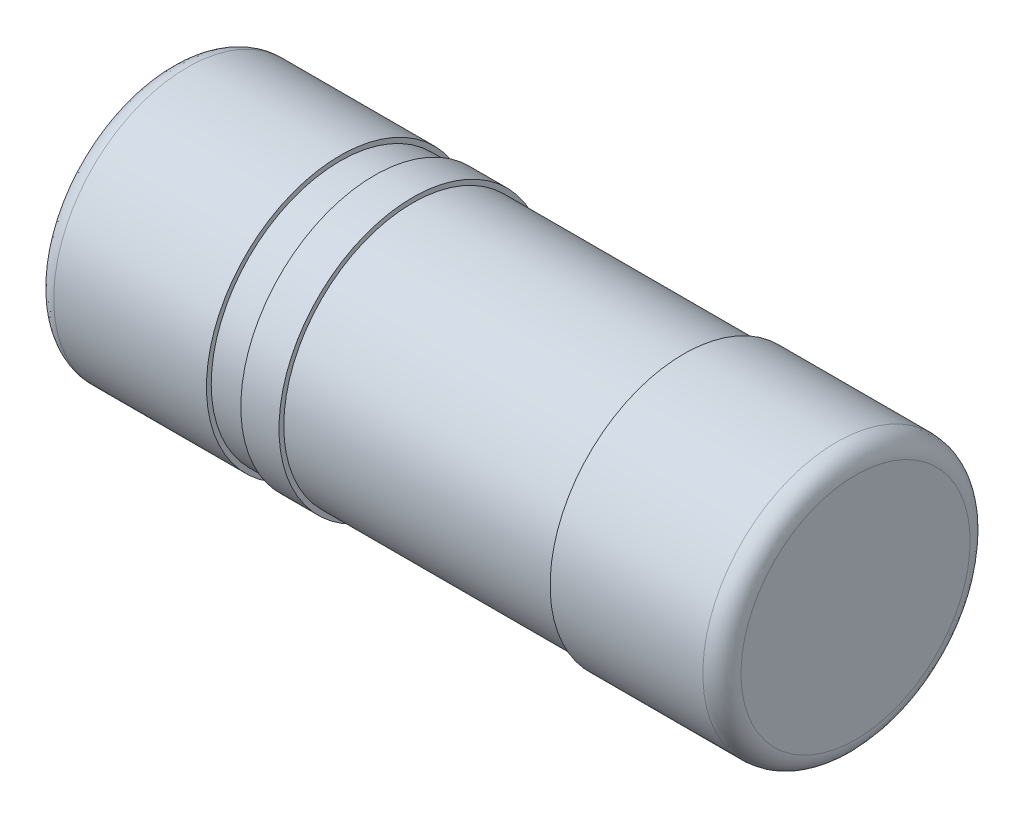
ISO-10303-21;
HEADER;
FILE_DESCRIPTION(('STEP AP214'),'2;1');
FILE_NAME('part.step','',(''),(''),'','','');
FILE_SCHEMA(('AUTOMOTIVE_DESIGN { 1 0 10303 214 1 1 1 1 }'));
ENDSEC;
DATA;
#1=APPLICATION_CONTEXT('core data for automotive mechanical design processes');
#2=APPLICATION_PROTOCOL_DEFINITION('international standard','automotive_design',2000,#1);
#3=PRODUCT_CONTEXT('',#1,'mechanical');
#4=PRODUCT('Part','Part','',(#3));
#5=PRODUCT_RELATED_PRODUCT_CATEGORY('part','',(#4));
#6=PRODUCT_DEFINITION_FORMATION('','',#4);
#7=PRODUCT_DEFINITION_CONTEXT('part definition',#1,'design');
#8=PRODUCT_DEFINITION('design','',#6,#7);
#9=PRODUCT_DEFINITION_SHAPE('','',#8);
#10=(LENGTH_UNIT() NAMED_UNIT(*) SI_UNIT(.MILLI.,.METRE.));
#11=(NAMED_UNIT(*) PLANE_ANGLE_UNIT() SI_UNIT($,.RADIAN.));
#12=(NAMED_UNIT(*) SI_UNIT($,.STERADIAN.) SOLID_ANGLE_UNIT());
#13=UNCERTAINTY_MEASURE_WITH_UNIT(LENGTH_MEASURE(1.E-05),#10,'distance_accuracy_value','');
#14=(GEOMETRIC_REPRESENTATION_CONTEXT(3) GLOBAL_UNCERTAINTY_ASSIGNED_CONTEXT((#13)) GLOBAL_UNIT_ASSIGNED_CONTEXT((#10,
#11,#12)) REPRESENTATION_CONTEXT('',''));
#15=CARTESIAN_POINT('',(0.,0.,0.));
#16=DIRECTION('',(0.,0.,1.));
#17=DIRECTION('',(1.,0.,0.));
#18=AXIS2_PLACEMENT_3D('',#15,#16,#17);
#19=CARTESIAN_POINT('',(-1.8,0.,0.7));
#20=DIRECTION('',(-1.,0.,0.));
#21=DIRECTION('',(0.,0.,1.));
#22=AXIS2_PLACEMENT_3D('',#19,#20,#21);
#23=PLANE('',#22);
#24=CARTESIAN_POINT('',(-1.8,0.,0.7));
#25=DIRECTION('',(-1.,0.,0.));
#26=DIRECTION('',(0.,0.,-1.));
#27=AXIS2_PLACEMENT_3D('',#24,#25,#26);
#28=CIRCLE('',#27,0.6);
#29=CARTESIAN_POINT('',(-1.8,0.,0.1));
#30=VERTEX_POINT('',#29);
#31=EDGE_CURVE('E11',#30,#30,#28,.T.);
#32=ORIENTED_EDGE('',*,*,#31,.T.);
#33=EDGE_LOOP('',(#32));
#34=FACE_BOUND('',#33,.T.);
#35=ADVANCED_FACE('F17',(#34),#23,.T.);
#36=CARTESIAN_POINT('',(1.8,0.,0.7));
#37=DIRECTION('',(-1.,0.,0.));
#38=DIRECTION('',(0.,0.,1.));
#39=AXIS2_PLACEMENT_3D('',#36,#37,#38);
#40=PLANE('',#39);
#41=CARTESIAN_POINT('',(1.8,0.,0.7));
#42=DIRECTION('',(-1.,0.,0.));
#43=DIRECTION('',(0.,0.,-1.));
#44=AXIS2_PLACEMENT_3D('',#41,#42,#43);
#45=CIRCLE('',#44,0.6);
#46=CARTESIAN_POINT('',(1.8,0.,0.1));
#47=VERTEX_POINT('',#46);
#48=EDGE_CURVE('E47',#47,#47,#45,.T.);
#49=ORIENTED_EDGE('',*,*,#48,.F.);
#50=EDGE_LOOP('',(#49));
#51=FACE_BOUND('',#50,.T.);
#52=ADVANCED_FACE('F165',(#51),#40,.F.);
#53=CARTESIAN_POINT('',(-1.8,0.,0.1));
#54=CARTESIAN_POINT('',(-1.8,0.,0.0414213562373097));
#55=CARTESIAN_POINT('',(-1.75857864376269,0.,0.));
#56=CARTESIAN_POINT('',(-1.7,0.,0.));
#57=(BOUNDED_CURVE() B_SPLINE_CURVE(3,(#53,#54,#55,#56),.UNSPECIFIED.,.F.,
.F.) B_SPLINE_CURVE_WITH_KNOTS((4,4),(0.,1.),
.UNSPECIFIED.) CURVE() GEOMETRIC_REPRESENTATION_ITEM() RATIONAL_B_SPLINE_CURVE((1.,
0.804737854124365,0.804737854124365,1.)) REPRESENTATION_ITEM(''));
#58=CARTESIAN_POINT('',(-8.2,0.,0.7));
#59=DIRECTION('',(1.,0.,0.));
#60=AXIS1_PLACEMENT('',#58,#59);
#61=SURFACE_OF_REVOLUTION('',#57,#60);
#62=CARTESIAN_POINT('',(-1.7,0.,0.1));
#63=DIRECTION('',(0.,-1.,0.));
#64=DIRECTION('',(1.,0.,0.));
#65=AXIS2_PLACEMENT_3D('',#62,#63,#64);
#66=CIRCLE('',#65,0.1);
#67=CARTESIAN_POINT('',(-1.7,0.,0.));
#68=VERTEX_POINT('',#67);
#69=EDGE_CURVE('E29',#30,#68,#66,.T.);
#70=ORIENTED_EDGE('',*,*,#69,.T.);
#71=CARTESIAN_POINT('',(-1.7,0.,0.7));
#72=DIRECTION('',(-1.,0.,0.));
#73=DIRECTION('',(0.,0.,-1.));
#74=AXIS2_PLACEMENT_3D('',#71,#72,#73);
#75=CIRCLE('',#74,0.7);
#76=EDGE_CURVE('E122',#68,#68,#75,.T.);
#77=ORIENTED_EDGE('',*,*,#76,.T.);
#78=ORIENTED_EDGE('',*,*,#69,.F.);
#79=ORIENTED_EDGE('',*,*,#31,.F.);
#80=EDGE_LOOP('',(#70,#77,#78,#79));
#81=FACE_BOUND('',#80,.T.);
#82=ADVANCED_FACE('F162',(#81),#61,.T.);
#83=CARTESIAN_POINT('',(1.7,0.,0.));
#84=CARTESIAN_POINT('',(1.75857864376269,0.,0.));
#85=CARTESIAN_POINT('',(1.8,0.,0.0414213562373096));
#86=CARTESIAN_POINT('',(1.8,0.,0.1));
#87=(BOUNDED_CURVE() B_SPLINE_CURVE(3,(#83,#84,#85,#86),.UNSPECIFIED.,.F.,
.F.) B_SPLINE_CURVE_WITH_KNOTS((4,4),(0.,1.),
.UNSPECIFIED.) CURVE() GEOMETRIC_REPRESENTATION_ITEM() RATIONAL_B_SPLINE_CURVE((1.,
0.804737854124366,0.804737854124366,1.)) REPRESENTATION_ITEM(''));
#88=CARTESIAN_POINT('',(-8.2,0.,0.7));
#89=DIRECTION('',(1.,0.,0.));
#90=AXIS1_PLACEMENT('',#88,#89);
#91=SURFACE_OF_REVOLUTION('',#87,#90);
#92=CARTESIAN_POINT('',(1.7,0.,0.1));
#93=DIRECTION('',(0.,-1.,0.));
#94=DIRECTION('',(1.,0.,0.));
#95=AXIS2_PLACEMENT_3D('',#92,#93,#94);
#96=CIRCLE('',#95,0.1);
#97=CARTESIAN_POINT('',(1.7,0.,0.));
#98=VERTEX_POINT('',#97);
#99=EDGE_CURVE('E119',#98,#47,#96,.T.);
#100=ORIENTED_EDGE('',*,*,#99,.T.);
#101=ORIENTED_EDGE('',*,*,#48,.T.);
#102=ORIENTED_EDGE('',*,*,#99,.F.);
#103=CARTESIAN_POINT('',(1.7,0.,0.7));
#104=DIRECTION('',(-1.,0.,0.));
#105=DIRECTION('',(0.,0.,-1.));
#106=AXIS2_PLACEMENT_3D('',#103,#104,#105);
#107=CIRCLE('',#106,0.7);
#108=EDGE_CURVE('E125',#98,#98,#107,.T.);
#109=ORIENTED_EDGE('',*,*,#108,.F.);
#110=EDGE_LOOP('',(#100,#101,#102,#109));
#111=FACE_BOUND('',#110,.T.);
#112=ADVANCED_FACE('F19',(#111),#91,.T.);
#113=CARTESIAN_POINT('',(-1.7,0.,0.7));
#114=DIRECTION('',(1.,0.,0.));
#115=DIRECTION('',(0.,0.,-1.));
#116=AXIS2_PLACEMENT_3D('',#113,#114,#115);
#117=CYLINDRICAL_SURFACE('',#116,0.7);
#118=DIRECTION('',(1.,0.,0.));
#119=VECTOR('',#118,1.);
#120=CARTESIAN_POINT('',(-1.7,0.,0.));
#121=LINE('',#120,#119);
#122=CARTESIAN_POINT('',(-0.9,0.,0.));
#123=VERTEX_POINT('',#122);
#124=EDGE_CURVE('E123',#68,#123,#121,.T.);
#125=ORIENTED_EDGE('',*,*,#124,.T.);
#126=CARTESIAN_POINT('',(-0.9,0.,0.7));
#127=DIRECTION('',(-1.,0.,0.));
#128=DIRECTION('',(0.,0.,-1.));
#129=AXIS2_PLACEMENT_3D('',#126,#127,#128);
#130=CIRCLE('',#129,0.7);
#131=EDGE_CURVE('E127',#123,#123,#130,.T.);
#132=ORIENTED_EDGE('',*,*,#131,.T.);
#133=ORIENTED_EDGE('',*,*,#124,.F.);
#134=ORIENTED_EDGE('',*,*,#76,.F.);
#135=EDGE_LOOP('',(#125,#132,#133,#134));
#136=FACE_BOUND('',#135,.T.);
#137=ADVANCED_FACE('F170',(#136),#117,.T.);
#138=CARTESIAN_POINT('',(0.9,0.,0.7));
#139=DIRECTION('',(1.,0.,0.));
#140=DIRECTION('',(0.,0.,-1.));
#141=AXIS2_PLACEMENT_3D('',#138,#139,#140);
#142=CYLINDRICAL_SURFACE('',#141,0.7);
#143=DIRECTION('',(1.,0.,0.));
#144=VECTOR('',#143,1.);
#145=CARTESIAN_POINT('',(0.9,0.,0.));
#146=LINE('',#145,#144);
#147=CARTESIAN_POINT('',(0.9,0.,0.));
#148=VERTEX_POINT('',#147);
#149=EDGE_CURVE('E131',#148,#98,#146,.T.);
#150=ORIENTED_EDGE('',*,*,#149,.T.);
#151=ORIENTED_EDGE('',*,*,#108,.T.);
#152=ORIENTED_EDGE('',*,*,#149,.F.);
#153=CARTESIAN_POINT('',(0.9,0.,0.7));
#154=DIRECTION('',(-1.,0.,0.));
#155=DIRECTION('',(0.,0.,-1.));
#156=AXIS2_PLACEMENT_3D('',#153,#154,#155);
#157=CIRCLE('',#156,0.7);
#158=EDGE_CURVE('E132',#148,#148,#157,.T.);
#159=ORIENTED_EDGE('',*,*,#158,.F.);
#160=EDGE_LOOP('',(#150,#151,#152,#159));
#161=FACE_BOUND('',#160,.T.);
#162=ADVANCED_FACE('F173',(#161),#142,.T.);
#163=CARTESIAN_POINT('',(-0.9,0.,0.7));
#164=DIRECTION('',(-1.,0.,0.));
#165=DIRECTION('',(0.,0.,1.));
#166=AXIS2_PLACEMENT_3D('',#163,#164,#165);
#167=PLANE('',#166);
#168=CARTESIAN_POINT('',(-0.9,0.,0.7));
#169=DIRECTION('',(-1.,0.,0.));
#170=DIRECTION('',(0.,0.,-1.));
#171=AXIS2_PLACEMENT_3D('',#168,#169,#170);
#172=CIRCLE('',#171,0.675);
#173=CARTESIAN_POINT('',(-0.9,0.,0.025));
#174=VERTEX_POINT('',#173);
#175=EDGE_CURVE('E138',#174,#174,#172,.T.);
#176=ORIENTED_EDGE('',*,*,#175,.T.);
#177=EDGE_LOOP('',(#176));
#178=FACE_BOUND('',#177,.T.);
#179=ORIENTED_EDGE('',*,*,#131,.F.);
#180=EDGE_LOOP('',(#179));
#181=FACE_BOUND('',#180,.T.);
#182=ADVANCED_FACE('F177',(#178,#181),#167,.F.);
#183=CARTESIAN_POINT('',(0.9,0.,0.7));
#184=DIRECTION('',(-1.,0.,0.));
#185=DIRECTION('',(0.,0.,1.));
#186=AXIS2_PLACEMENT_3D('',#183,#184,#185);
#187=PLANE('',#186);
#188=CARTESIAN_POINT('',(0.9,0.,0.7));
#189=DIRECTION('',(-1.,0.,0.));
#190=DIRECTION('',(0.,0.,-1.));
#191=AXIS2_PLACEMENT_3D('',#188,#189,#190);
#192=CIRCLE('',#191,0.675);
#193=CARTESIAN_POINT('',(0.9,0.,0.025));
#194=VERTEX_POINT('',#193);
#195=EDGE_CURVE('E95',#194,#194,#192,.T.);
#196=ORIENTED_EDGE('',*,*,#195,.F.);
#197=EDGE_LOOP('',(#196));
#198=FACE_BOUND('',#197,.T.);
#199=ORIENTED_EDGE('',*,*,#158,.T.);
#200=EDGE_LOOP('',(#199));
#201=FACE_BOUND('',#200,.T.);
#202=ADVANCED_FACE('F181',(#198,#201),#187,.T.);
#203=CARTESIAN_POINT('',(1.35,0.,0.7));
#204=DIRECTION('',(-1.,0.,0.));
#205=DIRECTION('',(0.,0.,-1.));
#206=AXIS2_PLACEMENT_3D('',#203,#204,#205);
#207=CYLINDRICAL_SURFACE('',#206,0.675);
#208=CARTESIAN_POINT('',(-0.72,0.,0.7));
#209=DIRECTION('',(-1.,0.,0.));
#210=DIRECTION('',(0.,0.,-1.));
#211=AXIS2_PLACEMENT_3D('',#208,#209,#210);
#212=CIRCLE('',#211,0.675);
#213=CARTESIAN_POINT('',(-0.72,0.,0.025));
#214=VERTEX_POINT('',#213);
#215=EDGE_CURVE('E103',#214,#214,#212,.T.);
#216=ORIENTED_EDGE('',*,*,#215,.T.);
#217=DIRECTION('',(-1.,0.,0.));
#218=VECTOR('',#217,1.);
#219=CARTESIAN_POINT('',(1.35,0.,0.025));
#220=LINE('',#219,#218);
#221=EDGE_CURVE('E97',#214,#174,#220,.T.);
#222=ORIENTED_EDGE('',*,*,#221,.T.);
#223=ORIENTED_EDGE('',*,*,#175,.F.);
#224=ORIENTED_EDGE('',*,*,#221,.F.);
#225=EDGE_LOOP('',(#216,#222,#223,#224));
#226=FACE_BOUND('',#225,.T.);
#227=ADVANCED_FACE('F183',(#226),#207,.T.);
#228=CARTESIAN_POINT('',(1.35,0.,0.7));
#229=DIRECTION('',(-1.,0.,0.));
#230=DIRECTION('',(0.,0.,-1.));
#231=AXIS2_PLACEMENT_3D('',#228,#229,#230);
#232=CYLINDRICAL_SURFACE('',#231,0.675);
#233=ORIENTED_EDGE('',*,*,#195,.T.);
#234=DIRECTION('',(-1.,0.,0.));
#235=VECTOR('',#234,1.);
#236=CARTESIAN_POINT('',(1.35,0.,0.025));
#237=LINE('',#236,#235);
#238=CARTESIAN_POINT('',(-0.52,0.,0.025));
#239=VERTEX_POINT('',#238);
#240=EDGE_CURVE('E90',#194,#239,#237,.T.);
#241=ORIENTED_EDGE('',*,*,#240,.T.);
#242=CARTESIAN_POINT('',(-0.52,0.,0.7));
#243=DIRECTION('',(-1.,0.,0.));
#244=DIRECTION('',(0.,0.,-1.));
#245=AXIS2_PLACEMENT_3D('',#242,#243,#244);
#246=CIRCLE('',#245,0.675);
#247=EDGE_CURVE('E93',#239,#239,#246,.T.);
#248=ORIENTED_EDGE('',*,*,#247,.F.);
#249=ORIENTED_EDGE('',*,*,#240,.F.);
#250=EDGE_LOOP('',(#233,#241,#248,#249));
#251=FACE_BOUND('',#250,.T.);
#252=ADVANCED_FACE('F92',(#251),#232,.T.);
#253=CARTESIAN_POINT('',(-0.72,0.,0.7));
#254=DIRECTION('',(-1.,0.,0.));
#255=DIRECTION('',(0.,1.,0.));
#256=AXIS2_PLACEMENT_3D('',#253,#254,#255);
#257=PLANE('',#256);
#258=ORIENTED_EDGE('',*,*,#215,.F.);
#259=EDGE_LOOP('',(#258));
#260=FACE_BOUND('',#259,.T.);
#261=CARTESIAN_POINT('',(-0.72,0.,0.7));
#262=DIRECTION('',(1.,0.,0.));
#263=DIRECTION('',(0.,0.,-1.));
#264=AXIS2_PLACEMENT_3D('',#261,#262,#263);
#265=CIRCLE('',#264,0.7);
#266=CARTESIAN_POINT('',(-0.72,0.,0.));
#267=VERTEX_POINT('',#266);
#268=EDGE_CURVE('E113',#267,#267,#265,.T.);
#269=ORIENTED_EDGE('',*,*,#268,.F.);
#270=EDGE_LOOP('',(#269));
#271=FACE_BOUND('',#270,.T.);
#272=ADVANCED_FACE('F190',(#260,#271),#257,.T.);
#273=CARTESIAN_POINT('',(-0.52,0.,0.7));
#274=DIRECTION('',(1.,0.,0.));
#275=DIRECTION('',(0.,1.,0.));
#276=AXIS2_PLACEMENT_3D('',#273,#274,#275);
#277=PLANE('',#276);
#278=ORIENTED_EDGE('',*,*,#247,.T.);
#279=EDGE_LOOP('',(#278));
#280=FACE_BOUND('',#279,.T.);
#281=CARTESIAN_POINT('',(-0.52,0.,0.7));
#282=DIRECTION('',(1.,0.,0.));
#283=DIRECTION('',(0.,0.,-1.));
#284=AXIS2_PLACEMENT_3D('',#281,#282,#283);
#285=CIRCLE('',#284,0.7);
#286=CARTESIAN_POINT('',(-0.52,0.,0.));
#287=VERTEX_POINT('',#286);
#288=EDGE_CURVE('E104',#287,#287,#285,.T.);
#289=ORIENTED_EDGE('',*,*,#288,.T.);
#290=EDGE_LOOP('',(#289));
#291=FACE_BOUND('',#290,.T.);
#292=ADVANCED_FACE('F100',(#280,#291),#277,.T.);
#293=CARTESIAN_POINT('',(-0.52,0.,0.7));
#294=DIRECTION('',(-1.,0.,0.));
#295=DIRECTION('',(0.,0.,-1.));
#296=AXIS2_PLACEMENT_3D('',#293,#294,#295);
#297=CYLINDRICAL_SURFACE('',#296,0.7);
#298=DIRECTION('',(-1.,0.,0.));
#299=VECTOR('',#298,1.);
#300=CARTESIAN_POINT('',(-0.52,0.,0.));
#301=LINE('',#300,#299);
#302=EDGE_CURVE('E117',#287,#267,#301,.T.);
#303=ORIENTED_EDGE('',*,*,#302,.T.);
#304=ORIENTED_EDGE('',*,*,#268,.T.);
#305=ORIENTED_EDGE('',*,*,#302,.F.);
#306=ORIENTED_EDGE('',*,*,#288,.F.);
#307=EDGE_LOOP('',(#303,#304,#305,#306));
#308=FACE_BOUND('',#307,.T.);
#309=ADVANCED_FACE('F196',(#308),#297,.T.);
#310=CLOSED_SHELL('',(#35,#52,#82,#112,#137,#162,#182,#202,#227,#252,#272,#292,#309));
#311=MANIFOLD_SOLID_BREP('B1',#310);
#312=ADVANCED_BREP_SHAPE_REPRESENTATION('',(#18,#311),#14);
#313=SHAPE_DEFINITION_REPRESENTATION(#9,#312);
ENDSEC;
END-ISO-10303-21;
